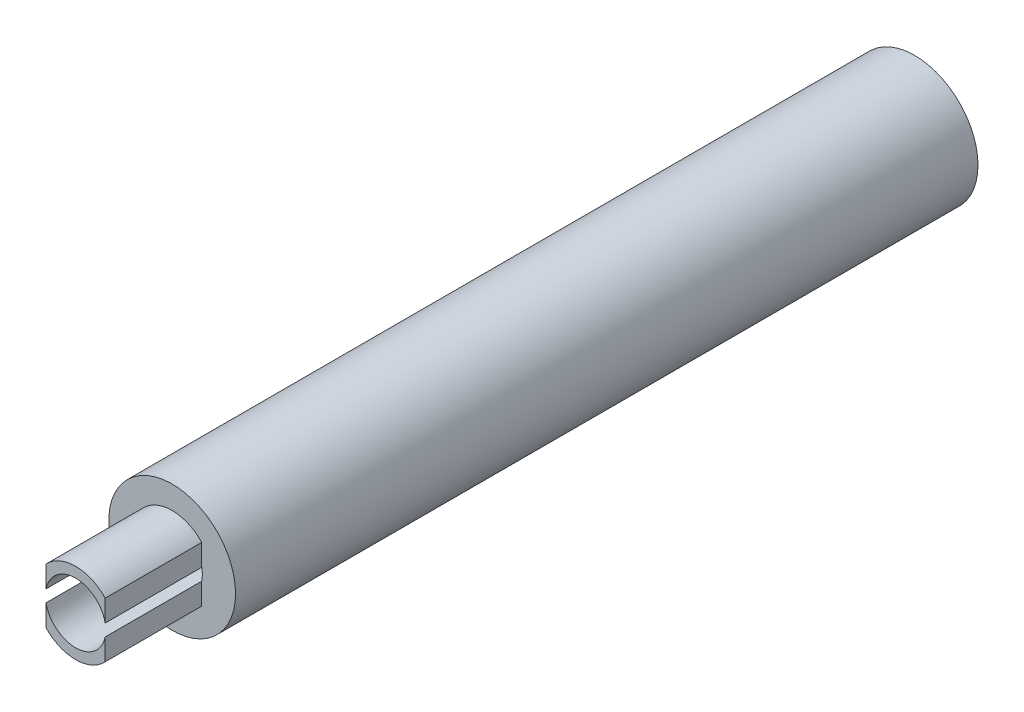
ISO-10303-21;
HEADER;
FILE_DESCRIPTION(('STEP AP214'),'2;1');
FILE_NAME('part.step','',(''),(''),'','','');
FILE_SCHEMA(('AUTOMOTIVE_DESIGN { 1 0 10303 214 1 1 1 1 }'));
ENDSEC;
DATA;
#1=APPLICATION_CONTEXT('core data for automotive mechanical design processes');
#2=APPLICATION_PROTOCOL_DEFINITION('international standard','automotive_design',2000,#1);
#3=PRODUCT_CONTEXT('',#1,'mechanical');
#4=PRODUCT('Part','Part','',(#3));
#5=PRODUCT_RELATED_PRODUCT_CATEGORY('part','',(#4));
#6=PRODUCT_DEFINITION_FORMATION('','',#4);
#7=PRODUCT_DEFINITION_CONTEXT('part definition',#1,'design');
#8=PRODUCT_DEFINITION('design','',#6,#7);
#9=PRODUCT_DEFINITION_SHAPE('','',#8);
#10=(LENGTH_UNIT() NAMED_UNIT(*) SI_UNIT(.MILLI.,.METRE.));
#11=(NAMED_UNIT(*) PLANE_ANGLE_UNIT() SI_UNIT($,.RADIAN.));
#12=(NAMED_UNIT(*) SI_UNIT($,.STERADIAN.) SOLID_ANGLE_UNIT());
#13=UNCERTAINTY_MEASURE_WITH_UNIT(LENGTH_MEASURE(1.E-05),#10,'distance_accuracy_value','');
#14=(GEOMETRIC_REPRESENTATION_CONTEXT(3) GLOBAL_UNCERTAINTY_ASSIGNED_CONTEXT((#13)) GLOBAL_UNIT_ASSIGNED_CONTEXT((#10,
#11,#12)) REPRESENTATION_CONTEXT('',''));
#15=CARTESIAN_POINT('',(0.,0.,0.));
#16=DIRECTION('',(0.,0.,1.));
#17=DIRECTION('',(1.,0.,0.));
#18=AXIS2_PLACEMENT_3D('',#15,#16,#17);
#19=CARTESIAN_POINT('',(0.,0.,78.9752308678997));
#20=DIRECTION('',(0.,0.,-1.));
#21=DIRECTION('',(-1.,0.,0.));
#22=AXIS2_PLACEMENT_3D('',#19,#20,#21);
#23=CYLINDRICAL_SURFACE('',#22,3.35);
#24=CARTESIAN_POINT('',(0.,0.,69.5));
#25=DIRECTION('',(0.,0.,1.));
#26=DIRECTION('',(1.,0.,0.));
#27=AXIS2_PLACEMENT_3D('',#24,#25,#26);
#28=CIRCLE('',#27,3.35);
#29=CARTESIAN_POINT('',(-2.45,-2.28473193175917,69.5));
#30=VERTEX_POINT('',#29);
#31=CARTESIAN_POINT('',(2.45,-2.28473193175917,69.5));
#32=VERTEX_POINT('',#31);
#33=EDGE_CURVE('E123',#30,#32,#28,.T.);
#34=ORIENTED_EDGE('',*,*,#33,.F.);
#35=DIRECTION('',(0.,0.,-1.));
#36=VECTOR('',#35,1.);
#37=CARTESIAN_POINT('',(-2.45,-2.28473193175917,78.9752308678997));
#38=LINE('',#37,#36);
#39=CARTESIAN_POINT('',(-2.45,-2.28473193175917,61.5));
#40=VERTEX_POINT('',#39);
#41=EDGE_CURVE('E107',#30,#40,#38,.T.);
#42=ORIENTED_EDGE('',*,*,#41,.T.);
#43=CARTESIAN_POINT('',(0.,0.,61.5));
#44=DIRECTION('',(0.,0.,1.));
#45=DIRECTION('',(1.,0.,0.));
#46=AXIS2_PLACEMENT_3D('',#43,#44,#45);
#47=CIRCLE('',#46,3.35);
#48=CARTESIAN_POINT('',(2.45,-2.28473193175917,61.5));
#49=VERTEX_POINT('',#48);
#50=EDGE_CURVE('E124',#40,#49,#47,.T.);
#51=ORIENTED_EDGE('',*,*,#50,.T.);
#52=DIRECTION('',(0.,0.,-1.));
#53=VECTOR('',#52,1.);
#54=CARTESIAN_POINT('',(2.45,-2.28473193175917,78.9752308678997));
#55=LINE('',#54,#53);
#56=EDGE_CURVE('E301',#49,#32,#55,.F.);
#57=ORIENTED_EDGE('',*,*,#56,.T.);
#58=EDGE_LOOP('',(#34,#42,#51,#57));
#59=FACE_BOUND('',#58,.T.);
#60=ADVANCED_FACE('F34',(#59),#23,.T.);
#61=CARTESIAN_POINT('',(0.,0.,69.5));
#62=DIRECTION('',(0.,0.,1.));
#63=DIRECTION('',(0.986683821601808,-0.162650042081922,0.));
#64=AXIS2_PLACEMENT_3D('',#61,#62,#63);
#65=PLANE('',#64);
#66=DIRECTION('',(0.,1.,0.));
#67=VECTOR('',#66,1.);
#68=CARTESIAN_POINT('',(-2.45,0.,69.5));
#69=LINE('',#68,#67);
#70=CARTESIAN_POINT('',(-2.45,-0.497493718553311,69.5));
#71=VERTEX_POINT('',#70);
#72=EDGE_CURVE('E11',#30,#71,#69,.T.);
#73=ORIENTED_EDGE('',*,*,#72,.F.);
#74=ORIENTED_EDGE('',*,*,#33,.T.);
#75=DIRECTION('',(0.,-1.,0.));
#76=VECTOR('',#75,1.);
#77=CARTESIAN_POINT('',(2.45,0.,69.5));
#78=LINE('',#77,#76);
#79=CARTESIAN_POINT('',(2.45,-0.497493718553311,69.5));
#80=VERTEX_POINT('',#79);
#81=EDGE_CURVE('E136',#80,#32,#78,.T.);
#82=ORIENTED_EDGE('',*,*,#81,.F.);
#83=CARTESIAN_POINT('',(0.,0.,69.5));
#84=DIRECTION('',(0.,0.,1.));
#85=DIRECTION('',(1.,0.,0.));
#86=AXIS2_PLACEMENT_3D('',#83,#84,#85);
#87=CIRCLE('',#86,2.5);
#88=EDGE_CURVE('E57',#71,#80,#87,.T.);
#89=ORIENTED_EDGE('',*,*,#88,.F.);
#90=EDGE_LOOP('',(#73,#74,#82,#89));
#91=FACE_BOUND('',#90,.T.);
#92=ADVANCED_FACE('F166',(#91),#65,.T.);
#93=CARTESIAN_POINT('',(0.,0.,0.));
#94=DIRECTION('',(0.,0.,1.));
#95=DIRECTION('',(1.,0.,0.));
#96=AXIS2_PLACEMENT_3D('',#93,#94,#95);
#97=CYLINDRICAL_SURFACE('',#96,2.5);
#98=CARTESIAN_POINT('',(2.45,0.497493718553311,69.5));
#99=VERTEX_POINT('',#98);
#100=CARTESIAN_POINT('',(-2.45,0.497493718553311,69.5));
#101=VERTEX_POINT('',#100);
#102=EDGE_CURVE('E128',#99,#101,#87,.T.);
#103=ORIENTED_EDGE('',*,*,#102,.T.);
#104=DIRECTION('',(0.,0.,1.));
#105=VECTOR('',#104,1.);
#106=CARTESIAN_POINT('',(-2.45,0.497493718553311,0.));
#107=LINE('',#106,#105);
#108=CARTESIAN_POINT('',(-2.45,0.497493718553311,61.5));
#109=VERTEX_POINT('',#108);
#110=EDGE_CURVE('E49',#101,#109,#107,.F.);
#111=ORIENTED_EDGE('',*,*,#110,.T.);
#112=CARTESIAN_POINT('',(0.,0.,61.5));
#113=DIRECTION('',(0.,0.,1.));
#114=DIRECTION('',(1.,0.,0.));
#115=AXIS2_PLACEMENT_3D('',#112,#113,#114);
#116=CIRCLE('',#115,2.5);
#117=CARTESIAN_POINT('',(-2.45,-0.497493718553311,61.5));
#118=VERTEX_POINT('',#117);
#119=EDGE_CURVE('E117',#118,#109,#116,.F.);
#120=ORIENTED_EDGE('',*,*,#119,.F.);
#121=DIRECTION('',(0.,0.,1.));
#122=VECTOR('',#121,1.);
#123=CARTESIAN_POINT('',(-2.45,-0.497493718553311,0.));
#124=LINE('',#123,#122);
#125=EDGE_CURVE('E308',#118,#71,#124,.T.);
#126=ORIENTED_EDGE('',*,*,#125,.T.);
#127=ORIENTED_EDGE('',*,*,#88,.T.);
#128=DIRECTION('',(0.,0.,1.));
#129=VECTOR('',#128,1.);
#130=CARTESIAN_POINT('',(2.45,-0.497493718553311,0.));
#131=LINE('',#130,#129);
#132=CARTESIAN_POINT('',(2.45,-0.497493718553311,61.5));
#133=VERTEX_POINT('',#132);
#134=EDGE_CURVE('E160',#80,#133,#131,.F.);
#135=ORIENTED_EDGE('',*,*,#134,.T.);
#136=CARTESIAN_POINT('',(0.,0.,61.5));
#137=DIRECTION('',(0.,0.,1.));
#138=DIRECTION('',(1.,0.,0.));
#139=AXIS2_PLACEMENT_3D('',#136,#137,#138);
#140=CIRCLE('',#139,2.5);
#141=CARTESIAN_POINT('',(2.45,0.497493718553311,61.5));
#142=VERTEX_POINT('',#141);
#143=EDGE_CURVE('E159',#142,#133,#140,.F.);
#144=ORIENTED_EDGE('',*,*,#143,.F.);
#145=DIRECTION('',(0.,0.,1.));
#146=VECTOR('',#145,1.);
#147=CARTESIAN_POINT('',(2.45,0.497493718553311,0.));
#148=LINE('',#147,#146);
#149=EDGE_CURVE('E152',#142,#99,#148,.T.);
#150=ORIENTED_EDGE('',*,*,#149,.T.);
#151=EDGE_LOOP('',(#103,#111,#120,#126,#127,#135,#144,#150));
#152=FACE_BOUND('',#151,.T.);
#153=CARTESIAN_POINT('',(0.,0.,18.));
#154=DIRECTION('',(0.,0.,-1.));
#155=DIRECTION('',(-1.,0.,0.));
#156=AXIS2_PLACEMENT_3D('',#153,#154,#155);
#157=CIRCLE('',#156,2.5);
#158=CARTESIAN_POINT('',(-2.5,0.,18.));
#159=VERTEX_POINT('',#158);
#160=EDGE_CURVE('E139',#159,#159,#157,.F.);
#161=ORIENTED_EDGE('',*,*,#160,.F.);
#162=EDGE_LOOP('',(#161));
#163=FACE_BOUND('',#162,.T.);
#164=ADVANCED_FACE('F157',(#152,#163),#97,.F.);
#165=CARTESIAN_POINT('',(0.,0.,61.5));
#166=DIRECTION('',(0.,0.,-1.));
#167=DIRECTION('',(-1.,0.,0.));
#168=AXIS2_PLACEMENT_3D('',#165,#166,#167);
#169=CYLINDRICAL_SURFACE('',#168,5.25);
#170=CARTESIAN_POINT('',(0.,0.,61.5));
#171=DIRECTION('',(0.,0.,1.));
#172=DIRECTION('',(1.,0.,0.));
#173=AXIS2_PLACEMENT_3D('',#170,#171,#172);
#174=CIRCLE('',#173,5.25);
#175=CARTESIAN_POINT('',(5.25,0.,61.5));
#176=VERTEX_POINT('',#175);
#177=EDGE_CURVE('E133',#176,#176,#174,.T.);
#178=ORIENTED_EDGE('',*,*,#177,.F.);
#179=EDGE_LOOP('',(#178));
#180=FACE_BOUND('',#179,.T.);
#181=CARTESIAN_POINT('',(0.,0.,0.));
#182=DIRECTION('',(0.,0.,1.));
#183=DIRECTION('',(1.,0.,0.));
#184=AXIS2_PLACEMENT_3D('',#181,#182,#183);
#185=CIRCLE('',#184,5.25);
#186=CARTESIAN_POINT('',(5.25,0.,0.));
#187=VERTEX_POINT('',#186);
#188=EDGE_CURVE('E132',#187,#187,#185,.T.);
#189=ORIENTED_EDGE('',*,*,#188,.T.);
#190=EDGE_LOOP('',(#189));
#191=FACE_BOUND('',#190,.T.);
#192=ADVANCED_FACE('F36',(#180,#191),#169,.T.);
#193=CARTESIAN_POINT('',(0.,0.,61.5));
#194=DIRECTION('',(0.,0.,1.));
#195=DIRECTION('',(1.,0.,0.));
#196=AXIS2_PLACEMENT_3D('',#193,#194,#195);
#197=PLANE('',#196);
#198=ORIENTED_EDGE('',*,*,#177,.T.);
#199=EDGE_LOOP('',(#198));
#200=FACE_BOUND('',#199,.T.);
#201=ORIENTED_EDGE('',*,*,#50,.F.);
#202=DIRECTION('',(0.,-1.,0.));
#203=VECTOR('',#202,1.);
#204=CARTESIAN_POINT('',(-2.45,4.61654632815485,61.5));
#205=LINE('',#204,#203);
#206=EDGE_CURVE('E118',#118,#40,#205,.T.);
#207=ORIENTED_EDGE('',*,*,#206,.F.);
#208=ORIENTED_EDGE('',*,*,#119,.T.);
#209=CARTESIAN_POINT('',(-2.45,2.28473193175917,61.5));
#210=VERTEX_POINT('',#209);
#211=EDGE_CURVE('E102',#210,#109,#205,.T.);
#212=ORIENTED_EDGE('',*,*,#211,.F.);
#213=CARTESIAN_POINT('',(2.45,2.28473193175917,61.5));
#214=VERTEX_POINT('',#213);
#215=EDGE_CURVE('E114',#214,#210,#47,.T.);
#216=ORIENTED_EDGE('',*,*,#215,.F.);
#217=DIRECTION('',(0.,1.,0.));
#218=VECTOR('',#217,1.);
#219=CARTESIAN_POINT('',(2.45,4.61654632815485,61.5));
#220=LINE('',#219,#218);
#221=EDGE_CURVE('E304',#142,#214,#220,.T.);
#222=ORIENTED_EDGE('',*,*,#221,.F.);
#223=ORIENTED_EDGE('',*,*,#143,.T.);
#224=EDGE_CURVE('E303',#49,#133,#220,.T.);
#225=ORIENTED_EDGE('',*,*,#224,.F.);
#226=EDGE_LOOP('',(#201,#207,#208,#212,#216,#222,#223,#225));
#227=FACE_BOUND('',#226,.T.);
#228=ADVANCED_FACE('F112',(#200,#227),#197,.T.);
#229=CARTESIAN_POINT('',(0.,0.,0.));
#230=DIRECTION('',(0.,0.,1.));
#231=DIRECTION('',(1.,0.,0.));
#232=AXIS2_PLACEMENT_3D('',#229,#230,#231);
#233=PLANE('',#232);
#234=CARTESIAN_POINT('',(0.,0.,0.));
#235=DIRECTION('',(0.,0.,-1.));
#236=DIRECTION('',(-1.,0.,0.));
#237=AXIS2_PLACEMENT_3D('',#234,#235,#236);
#238=CIRCLE('',#237,3.05);
#239=CARTESIAN_POINT('',(-3.05,0.,0.));
#240=VERTEX_POINT('',#239);
#241=EDGE_CURVE('E293',#240,#240,#238,.T.);
#242=ORIENTED_EDGE('',*,*,#241,.F.);
#243=EDGE_LOOP('',(#242));
#244=FACE_BOUND('',#243,.T.);
#245=ORIENTED_EDGE('',*,*,#188,.F.);
#246=EDGE_LOOP('',(#245));
#247=FACE_BOUND('',#246,.T.);
#248=ADVANCED_FACE('F174',(#244,#247),#233,.F.);
#249=ORIENTED_EDGE('',*,*,#215,.T.);
#250=DIRECTION('',(0.,0.,-1.));
#251=VECTOR('',#250,1.);
#252=CARTESIAN_POINT('',(-2.45,2.28473193175917,78.9752308678997));
#253=LINE('',#252,#251);
#254=CARTESIAN_POINT('',(-2.45,2.28473193175917,69.5));
#255=VERTEX_POINT('',#254);
#256=EDGE_CURVE('E99',#210,#255,#253,.F.);
#257=ORIENTED_EDGE('',*,*,#256,.T.);
#258=CARTESIAN_POINT('',(2.45,2.28473193175917,69.5));
#259=VERTEX_POINT('',#258);
#260=EDGE_CURVE('E126',#259,#255,#28,.T.);
#261=ORIENTED_EDGE('',*,*,#260,.F.);
#262=DIRECTION('',(0.,0.,-1.));
#263=VECTOR('',#262,1.);
#264=CARTESIAN_POINT('',(2.45,2.28473193175917,78.9752308678997));
#265=LINE('',#264,#263);
#266=EDGE_CURVE('E122',#259,#214,#265,.T.);
#267=ORIENTED_EDGE('',*,*,#266,.T.);
#268=EDGE_LOOP('',(#249,#257,#261,#267));
#269=FACE_BOUND('',#268,.T.);
#270=ADVANCED_FACE('F121',(#269),#23,.T.);
#271=EDGE_CURVE('E38',#101,#255,#69,.T.);
#272=ORIENTED_EDGE('',*,*,#271,.F.);
#273=ORIENTED_EDGE('',*,*,#102,.F.);
#274=EDGE_CURVE('E143',#259,#99,#78,.T.);
#275=ORIENTED_EDGE('',*,*,#274,.F.);
#276=ORIENTED_EDGE('',*,*,#260,.T.);
#277=EDGE_LOOP('',(#272,#273,#275,#276));
#278=FACE_BOUND('',#277,.T.);
#279=ADVANCED_FACE('F162',(#278),#65,.T.);
#280=CARTESIAN_POINT('',(0.,0.,18.));
#281=DIRECTION('',(0.,0.,-1.));
#282=DIRECTION('',(-1.,0.,0.));
#283=AXIS2_PLACEMENT_3D('',#280,#281,#282);
#284=PLANE('',#283);
#285=CARTESIAN_POINT('',(0.,0.,18.));
#286=DIRECTION('',(0.,0.,-1.));
#287=DIRECTION('',(-1.,0.,0.));
#288=AXIS2_PLACEMENT_3D('',#285,#286,#287);
#289=CIRCLE('',#288,3.05);
#290=CARTESIAN_POINT('',(-3.05,0.,18.));
#291=VERTEX_POINT('',#290);
#292=EDGE_CURVE('E141',#291,#291,#289,.T.);
#293=ORIENTED_EDGE('',*,*,#292,.T.);
#294=EDGE_LOOP('',(#293));
#295=FACE_BOUND('',#294,.T.);
#296=ORIENTED_EDGE('',*,*,#160,.T.);
#297=EDGE_LOOP('',(#296));
#298=FACE_BOUND('',#297,.T.);
#299=ADVANCED_FACE('F164',(#295,#298),#284,.T.);
#300=CARTESIAN_POINT('',(0.,0.,18.));
#301=DIRECTION('',(0.,0.,-1.));
#302=DIRECTION('',(-1.,0.,0.));
#303=AXIS2_PLACEMENT_3D('',#300,#301,#302);
#304=CYLINDRICAL_SURFACE('',#303,3.05);
#305=ORIENTED_EDGE('',*,*,#292,.F.);
#306=EDGE_LOOP('',(#305));
#307=FACE_BOUND('',#306,.T.);
#308=ORIENTED_EDGE('',*,*,#241,.T.);
#309=EDGE_LOOP('',(#308));
#310=FACE_BOUND('',#309,.T.);
#311=ADVANCED_FACE('F171',(#307,#310),#304,.F.);
#312=CARTESIAN_POINT('',(2.45,4.61654632815485,52.07611388306));
#313=DIRECTION('',(-1.,0.,0.));
#314=DIRECTION('',(0.,0.,1.));
#315=AXIS2_PLACEMENT_3D('',#312,#313,#314);
#316=PLANE('',#315);
#317=ORIENTED_EDGE('',*,*,#81,.T.);
#318=ORIENTED_EDGE('',*,*,#56,.F.);
#319=ORIENTED_EDGE('',*,*,#224,.T.);
#320=ORIENTED_EDGE('',*,*,#134,.F.);
#321=EDGE_LOOP('',(#317,#318,#319,#320));
#322=FACE_BOUND('',#321,.T.);
#323=ADVANCED_FACE('F188',(#322),#316,.F.);
#324=ORIENTED_EDGE('',*,*,#221,.T.);
#325=ORIENTED_EDGE('',*,*,#266,.F.);
#326=ORIENTED_EDGE('',*,*,#274,.T.);
#327=ORIENTED_EDGE('',*,*,#149,.F.);
#328=EDGE_LOOP('',(#324,#325,#326,#327));
#329=FACE_BOUND('',#328,.T.);
#330=ADVANCED_FACE('F151',(#329),#316,.F.);
#331=CARTESIAN_POINT('',(-2.45,4.61654632815485,52.07611388306));
#332=DIRECTION('',(1.,0.,0.));
#333=DIRECTION('',(0.,0.,-1.));
#334=AXIS2_PLACEMENT_3D('',#331,#332,#333);
#335=PLANE('',#334);
#336=ORIENTED_EDGE('',*,*,#271,.T.);
#337=ORIENTED_EDGE('',*,*,#256,.F.);
#338=ORIENTED_EDGE('',*,*,#211,.T.);
#339=ORIENTED_EDGE('',*,*,#110,.F.);
#340=EDGE_LOOP('',(#336,#337,#338,#339));
#341=FACE_BOUND('',#340,.T.);
#342=ADVANCED_FACE('F101',(#341),#335,.F.);
#343=ORIENTED_EDGE('',*,*,#206,.T.);
#344=ORIENTED_EDGE('',*,*,#41,.F.);
#345=ORIENTED_EDGE('',*,*,#72,.T.);
#346=ORIENTED_EDGE('',*,*,#125,.F.);
#347=EDGE_LOOP('',(#343,#344,#345,#346));
#348=FACE_BOUND('',#347,.T.);
#349=ADVANCED_FACE('F194',(#348),#335,.F.);
#350=CLOSED_SHELL('',(#60,#92,#164,#192,#228,#248,#270,#279,#299,#311,#323,#330,#342,#349));
#351=MANIFOLD_SOLID_BREP('B2',#350);
#352=ADVANCED_BREP_SHAPE_REPRESENTATION('',(#18,#351),#14);
#353=SHAPE_DEFINITION_REPRESENTATION(#9,#352);
ENDSEC;
END-ISO-10303-21;
